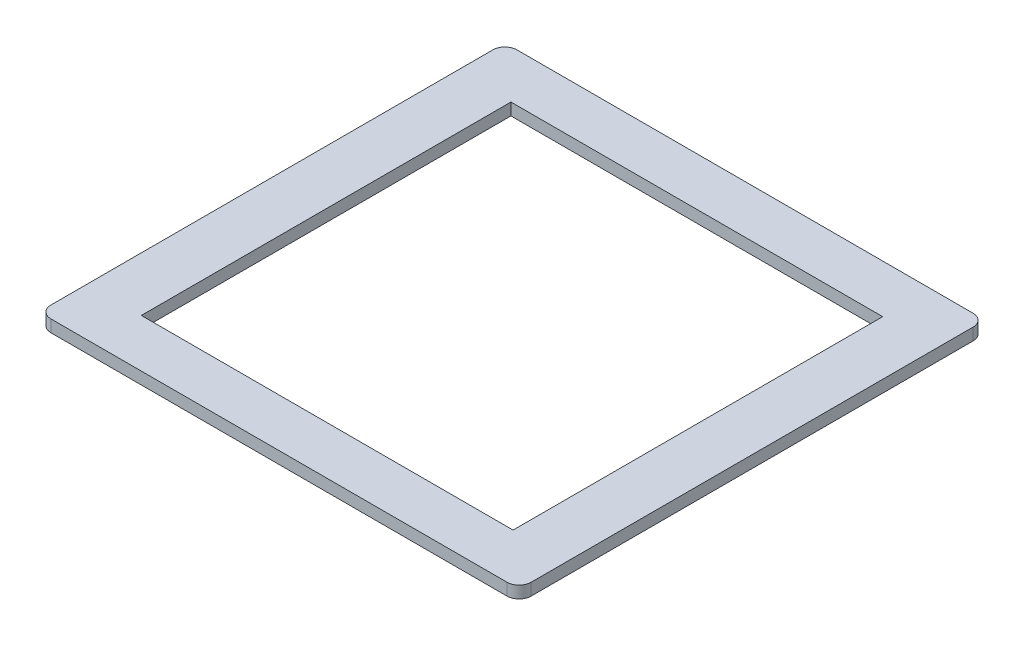
ISO-10303-21;
HEADER;
FILE_DESCRIPTION(('STEP AP214'),'2;1');
FILE_NAME('part.step','',(''),(''),'','','');
FILE_SCHEMA(('AUTOMOTIVE_DESIGN { 1 0 10303 214 1 1 1 1 }'));
ENDSEC;
DATA;
#1=APPLICATION_CONTEXT('core data for automotive mechanical design processes');
#2=APPLICATION_PROTOCOL_DEFINITION('international standard','automotive_design',2000,#1);
#3=PRODUCT_CONTEXT('',#1,'mechanical');
#4=PRODUCT('Part','Part','',(#3));
#5=PRODUCT_RELATED_PRODUCT_CATEGORY('part','',(#4));
#6=PRODUCT_DEFINITION_FORMATION('','',#4);
#7=PRODUCT_DEFINITION_CONTEXT('part definition',#1,'design');
#8=PRODUCT_DEFINITION('design','',#6,#7);
#9=PRODUCT_DEFINITION_SHAPE('','',#8);
#10=(LENGTH_UNIT() NAMED_UNIT(*) SI_UNIT(.MILLI.,.METRE.));
#11=(NAMED_UNIT(*) PLANE_ANGLE_UNIT() SI_UNIT($,.RADIAN.));
#12=(NAMED_UNIT(*) SI_UNIT($,.STERADIAN.) SOLID_ANGLE_UNIT());
#13=UNCERTAINTY_MEASURE_WITH_UNIT(LENGTH_MEASURE(1.E-05),#10,'distance_accuracy_value','');
#14=(GEOMETRIC_REPRESENTATION_CONTEXT(3) GLOBAL_UNCERTAINTY_ASSIGNED_CONTEXT((#13)) GLOBAL_UNIT_ASSIGNED_CONTEXT((#10,
#11,#12)) REPRESENTATION_CONTEXT('',''));
#15=CARTESIAN_POINT('',(0.,0.,0.));
#16=DIRECTION('',(0.,0.,1.));
#17=DIRECTION('',(1.,0.,0.));
#18=AXIS2_PLACEMENT_3D('',#15,#16,#17);
#19=CARTESIAN_POINT('',(119.15165550125,-5750.54008862985,-146.206803101356));
#20=DIRECTION('',(0.,-1.,0.));
#21=DIRECTION('',(0.,0.,-1.));
#22=AXIS2_PLACEMENT_3D('',#19,#20,#21);
#23=PLANE('',#22);
#24=CARTESIAN_POINT('',(119.15165550125,-5750.54008862985,-146.206803101356));
#25=DIRECTION('',(0.,1.,0.));
#26=DIRECTION('',(0.,0.,-1.));
#27=AXIS2_PLACEMENT_3D('',#24,#25,#26);
#28=CIRCLE('',#27,2.);
#29=CARTESIAN_POINT('',(121.15165550125,-5750.54008862985,-146.206803101356));
#30=VERTEX_POINT('',#29);
#31=CARTESIAN_POINT('',(119.15165550125,-5750.54008862985,-148.206803101356));
#32=VERTEX_POINT('',#31);
#33=EDGE_CURVE('E158',#30,#32,#28,.T.);
#34=ORIENTED_EDGE('',*,*,#33,.T.);
#35=DIRECTION('',(-1.,0.,0.));
#36=VECTOR('',#35,1.);
#37=CARTESIAN_POINT('',(43.4495128900275,-5750.54008862985,-148.206803101356));
#38=LINE('',#37,#36);
#39=CARTESIAN_POINT('',(43.4495128900275,-5750.54008862985,-148.206803101356));
#40=VERTEX_POINT('',#39);
#41=EDGE_CURVE('E161',#32,#40,#38,.T.);
#42=ORIENTED_EDGE('',*,*,#41,.T.);
#43=CARTESIAN_POINT('',(43.4495128900275,-5750.54008862985,-146.206803101356));
#44=DIRECTION('',(0.,1.,0.));
#45=DIRECTION('',(0.,0.,-1.));
#46=AXIS2_PLACEMENT_3D('',#43,#44,#45);
#47=CIRCLE('',#46,1.99999999999999);
#48=CARTESIAN_POINT('',(41.4495128900275,-5750.54008862985,-146.206803101356));
#49=VERTEX_POINT('',#48);
#50=EDGE_CURVE('E164',#40,#49,#47,.T.);
#51=ORIENTED_EDGE('',*,*,#50,.T.);
#52=DIRECTION('',(0.,0.,1.));
#53=VECTOR('',#52,1.);
#54=CARTESIAN_POINT('',(41.4495128900275,-5750.54008862985,-146.206803101356));
#55=LINE('',#54,#53);
#56=CARTESIAN_POINT('',(41.4495128900275,-5750.54008862985,-72.8595632023749));
#57=VERTEX_POINT('',#56);
#58=EDGE_CURVE('E166',#49,#57,#55,.T.);
#59=ORIENTED_EDGE('',*,*,#58,.T.);
#60=CARTESIAN_POINT('',(43.4495128900275,-5750.54008862985,-72.8595632023749));
#61=DIRECTION('',(0.,1.,0.));
#62=DIRECTION('',(0.,0.,-1.));
#63=AXIS2_PLACEMENT_3D('',#60,#61,#62);
#64=CIRCLE('',#63,2.00000000000002);
#65=CARTESIAN_POINT('',(43.4495128900275,-5750.54008862985,-70.8595632023748));
#66=VERTEX_POINT('',#65);
#67=EDGE_CURVE('E168',#57,#66,#64,.T.);
#68=ORIENTED_EDGE('',*,*,#67,.T.);
#69=DIRECTION('',(1.,0.,0.));
#70=VECTOR('',#69,1.);
#71=CARTESIAN_POINT('',(43.4495128900275,-5750.54008862985,-70.8595632023749));
#72=LINE('',#71,#70);
#73=CARTESIAN_POINT('',(119.15165550125,-5750.54008862985,-70.8595632023749));
#74=VERTEX_POINT('',#73);
#75=EDGE_CURVE('E170',#66,#74,#72,.T.);
#76=ORIENTED_EDGE('',*,*,#75,.T.);
#77=CARTESIAN_POINT('',(119.15165550125,-5750.54008862985,-72.8595632023749));
#78=DIRECTION('',(0.,1.,0.));
#79=DIRECTION('',(0.,0.,-1.));
#80=AXIS2_PLACEMENT_3D('',#77,#78,#79);
#81=CIRCLE('',#80,2.);
#82=CARTESIAN_POINT('',(121.15165550125,-5750.54008862985,-72.8595632023749));
#83=VERTEX_POINT('',#82);
#84=EDGE_CURVE('E172',#74,#83,#81,.T.);
#85=ORIENTED_EDGE('',*,*,#84,.T.);
#86=DIRECTION('',(0.,0.,-1.));
#87=VECTOR('',#86,1.);
#88=CARTESIAN_POINT('',(121.15165550125,-5750.54008862985,-146.206803101356));
#89=LINE('',#88,#87);
#90=EDGE_CURVE('E174',#83,#30,#89,.T.);
#91=ORIENTED_EDGE('',*,*,#90,.T.);
#92=EDGE_LOOP('',(#34,#42,#51,#59,#68,#76,#85,#91));
#93=FACE_BOUND('',#92,.T.);
#94=DIRECTION('',(0.,0.,1.));
#95=VECTOR('',#94,1.);
#96=CARTESIAN_POINT('',(50.4495128900275,-5750.54008862985,-140.206803101356));
#97=LINE('',#96,#95);
#98=CARTESIAN_POINT('',(50.4495128900275,-5750.54008862985,-140.206803101356));
#99=VERTEX_POINT('',#98);
#100=CARTESIAN_POINT('',(50.4495128900275,-5750.54008862985,-78.8595632023749));
#101=VERTEX_POINT('',#100);
#102=EDGE_CURVE('E122',#99,#101,#97,.T.);
#103=ORIENTED_EDGE('',*,*,#102,.F.);
#104=DIRECTION('',(-1.,0.,0.));
#105=VECTOR('',#104,1.);
#106=CARTESIAN_POINT('',(50.4495128900275,-5750.54008862985,-140.206803101356));
#107=LINE('',#106,#105);
#108=CARTESIAN_POINT('',(112.15165550125,-5750.54008862985,-140.206803101356));
#109=VERTEX_POINT('',#108);
#110=EDGE_CURVE('E144',#109,#99,#107,.T.);
#111=ORIENTED_EDGE('',*,*,#110,.F.);
#112=DIRECTION('',(0.,0.,-1.));
#113=VECTOR('',#112,1.);
#114=CARTESIAN_POINT('',(112.15165550125,-5750.54008862985,-140.206803101356));
#115=LINE('',#114,#113);
#116=CARTESIAN_POINT('',(112.15165550125,-5750.54008862985,-78.8595632023749));
#117=VERTEX_POINT('',#116);
#118=EDGE_CURVE('E142',#117,#109,#115,.T.);
#119=ORIENTED_EDGE('',*,*,#118,.F.);
#120=DIRECTION('',(1.,0.,0.));
#121=VECTOR('',#120,1.);
#122=CARTESIAN_POINT('',(50.4495128900275,-5750.54008862985,-78.8595632023749));
#123=LINE('',#122,#121);
#124=EDGE_CURVE('E130',#101,#117,#123,.T.);
#125=ORIENTED_EDGE('',*,*,#124,.F.);
#126=EDGE_LOOP('',(#103,#111,#119,#125));
#127=FACE_BOUND('',#126,.T.);
#128=ADVANCED_FACE('F33',(#93,#127),#23,.F.);
#129=CARTESIAN_POINT('',(119.15165550125,-5752.54008862985,-146.206803101356));
#130=DIRECTION('',(0.,-1.,0.));
#131=DIRECTION('',(0.,0.,-1.));
#132=AXIS2_PLACEMENT_3D('',#129,#130,#131);
#133=PLANE('',#132);
#134=CARTESIAN_POINT('',(119.15165550125,-5752.54008862985,-146.206803101356));
#135=DIRECTION('',(0.,1.,0.));
#136=DIRECTION('',(0.,0.,-1.));
#137=AXIS2_PLACEMENT_3D('',#134,#135,#136);
#138=CIRCLE('',#137,2.);
#139=CARTESIAN_POINT('',(121.15165550125,-5752.54008862985,-146.206803101356));
#140=VERTEX_POINT('',#139);
#141=CARTESIAN_POINT('',(119.15165550125,-5752.54008862985,-148.206803101356));
#142=VERTEX_POINT('',#141);
#143=EDGE_CURVE('E138',#140,#142,#138,.T.);
#144=ORIENTED_EDGE('',*,*,#143,.F.);
#145=DIRECTION('',(0.,0.,-1.));
#146=VECTOR('',#145,1.);
#147=CARTESIAN_POINT('',(121.15165550125,-5752.54008862985,-146.206803101356));
#148=LINE('',#147,#146);
#149=CARTESIAN_POINT('',(121.15165550125,-5752.54008862985,-72.8595632023749));
#150=VERTEX_POINT('',#149);
#151=EDGE_CURVE('E162',#150,#140,#148,.T.);
#152=ORIENTED_EDGE('',*,*,#151,.F.);
#153=CARTESIAN_POINT('',(119.15165550125,-5752.54008862985,-72.8595632023749));
#154=DIRECTION('',(0.,1.,0.));
#155=DIRECTION('',(0.,0.,-1.));
#156=AXIS2_PLACEMENT_3D('',#153,#154,#155);
#157=CIRCLE('',#156,2.);
#158=CARTESIAN_POINT('',(119.15165550125,-5752.54008862985,-70.8595632023749));
#159=VERTEX_POINT('',#158);
#160=EDGE_CURVE('E189',#159,#150,#157,.T.);
#161=ORIENTED_EDGE('',*,*,#160,.F.);
#162=DIRECTION('',(1.,0.,0.));
#163=VECTOR('',#162,1.);
#164=CARTESIAN_POINT('',(43.4495128900275,-5752.54008862985,-70.8595632023749));
#165=LINE('',#164,#163);
#166=CARTESIAN_POINT('',(43.4495128900275,-5752.54008862985,-70.8595632023748));
#167=VERTEX_POINT('',#166);
#168=EDGE_CURVE('E187',#167,#159,#165,.T.);
#169=ORIENTED_EDGE('',*,*,#168,.F.);
#170=CARTESIAN_POINT('',(43.4495128900275,-5752.54008862985,-72.8595632023749));
#171=DIRECTION('',(0.,1.,0.));
#172=DIRECTION('',(0.,0.,-1.));
#173=AXIS2_PLACEMENT_3D('',#170,#171,#172);
#174=CIRCLE('',#173,2.00000000000002);
#175=CARTESIAN_POINT('',(41.4495128900275,-5752.54008862985,-72.8595632023749));
#176=VERTEX_POINT('',#175);
#177=EDGE_CURVE('E185',#176,#167,#174,.T.);
#178=ORIENTED_EDGE('',*,*,#177,.F.);
#179=DIRECTION('',(0.,0.,1.));
#180=VECTOR('',#179,1.);
#181=CARTESIAN_POINT('',(41.4495128900275,-5752.54008862985,-146.206803101356));
#182=LINE('',#181,#180);
#183=CARTESIAN_POINT('',(41.4495128900275,-5752.54008862985,-146.206803101356));
#184=VERTEX_POINT('',#183);
#185=EDGE_CURVE('E183',#184,#176,#182,.T.);
#186=ORIENTED_EDGE('',*,*,#185,.F.);
#187=CARTESIAN_POINT('',(43.4495128900275,-5752.54008862985,-146.206803101356));
#188=DIRECTION('',(0.,1.,0.));
#189=DIRECTION('',(0.,0.,-1.));
#190=AXIS2_PLACEMENT_3D('',#187,#188,#189);
#191=CIRCLE('',#190,1.99999999999999);
#192=CARTESIAN_POINT('',(43.4495128900275,-5752.54008862985,-148.206803101356));
#193=VERTEX_POINT('',#192);
#194=EDGE_CURVE('E181',#193,#184,#191,.T.);
#195=ORIENTED_EDGE('',*,*,#194,.F.);
#196=DIRECTION('',(-1.,0.,0.));
#197=VECTOR('',#196,1.);
#198=CARTESIAN_POINT('',(43.4495128900275,-5752.54008862985,-148.206803101356));
#199=LINE('',#198,#197);
#200=EDGE_CURVE('E179',#142,#193,#199,.T.);
#201=ORIENTED_EDGE('',*,*,#200,.F.);
#202=EDGE_LOOP('',(#144,#152,#161,#169,#178,#186,#195,#201));
#203=FACE_BOUND('',#202,.T.);
#204=DIRECTION('',(-1.,0.,0.));
#205=VECTOR('',#204,1.);
#206=CARTESIAN_POINT('',(50.4495128900275,-5752.54008862985,-140.206803101356));
#207=LINE('',#206,#205);
#208=CARTESIAN_POINT('',(112.15165550125,-5752.54008862985,-140.206803101356));
#209=VERTEX_POINT('',#208);
#210=CARTESIAN_POINT('',(50.4495128900275,-5752.54008862985,-140.206803101356));
#211=VERTEX_POINT('',#210);
#212=EDGE_CURVE('E131',#209,#211,#207,.T.);
#213=ORIENTED_EDGE('',*,*,#212,.T.);
#214=DIRECTION('',(0.,0.,1.));
#215=VECTOR('',#214,1.);
#216=CARTESIAN_POINT('',(50.4495128900275,-5752.54008862985,-140.206803101356));
#217=LINE('',#216,#215);
#218=CARTESIAN_POINT('',(50.4495128900275,-5752.54008862985,-78.8595632023749));
#219=VERTEX_POINT('',#218);
#220=EDGE_CURVE('E56',#211,#219,#217,.T.);
#221=ORIENTED_EDGE('',*,*,#220,.T.);
#222=DIRECTION('',(1.,0.,0.));
#223=VECTOR('',#222,1.);
#224=CARTESIAN_POINT('',(50.4495128900275,-5752.54008862985,-78.8595632023749));
#225=LINE('',#224,#223);
#226=CARTESIAN_POINT('',(112.15165550125,-5752.54008862985,-78.8595632023749));
#227=VERTEX_POINT('',#226);
#228=EDGE_CURVE('E137',#219,#227,#225,.T.);
#229=ORIENTED_EDGE('',*,*,#228,.T.);
#230=DIRECTION('',(0.,0.,-1.));
#231=VECTOR('',#230,1.);
#232=CARTESIAN_POINT('',(112.15165550125,-5752.54008862985,-140.206803101356));
#233=LINE('',#232,#231);
#234=EDGE_CURVE('E150',#227,#209,#233,.T.);
#235=ORIENTED_EDGE('',*,*,#234,.T.);
#236=EDGE_LOOP('',(#213,#221,#229,#235));
#237=FACE_BOUND('',#236,.T.);
#238=ADVANCED_FACE('F219',(#203,#237),#133,.T.);
#239=CARTESIAN_POINT('',(119.15165550125,-5750.54008862985,-146.206803101356));
#240=DIRECTION('',(0.,-1.,0.));
#241=DIRECTION('',(0.,0.,-1.));
#242=AXIS2_PLACEMENT_3D('',#239,#240,#241);
#243=CYLINDRICAL_SURFACE('',#242,2.);
#244=ORIENTED_EDGE('',*,*,#143,.T.);
#245=DIRECTION('',(0.,-1.,0.));
#246=VECTOR('',#245,1.);
#247=CARTESIAN_POINT('',(119.15165550125,-5750.54008862985,-148.206803101356));
#248=LINE('',#247,#246);
#249=EDGE_CURVE('E11',#32,#142,#248,.T.);
#250=ORIENTED_EDGE('',*,*,#249,.F.);
#251=ORIENTED_EDGE('',*,*,#33,.F.);
#252=DIRECTION('',(0.,-1.,0.));
#253=VECTOR('',#252,1.);
#254=CARTESIAN_POINT('',(121.15165550125,-5750.54008862985,-146.206803101356));
#255=LINE('',#254,#253);
#256=EDGE_CURVE('E176',#30,#140,#255,.T.);
#257=ORIENTED_EDGE('',*,*,#256,.T.);
#258=EDGE_LOOP('',(#244,#250,#251,#257));
#259=FACE_BOUND('',#258,.T.);
#260=ADVANCED_FACE('F35',(#259),#243,.T.);
#261=CARTESIAN_POINT('',(43.4495128900275,-5750.54008862985,-148.206803101356));
#262=DIRECTION('',(0.,0.,1.));
#263=DIRECTION('',(1.,0.,0.));
#264=AXIS2_PLACEMENT_3D('',#261,#262,#263);
#265=PLANE('',#264);
#266=ORIENTED_EDGE('',*,*,#200,.T.);
#267=DIRECTION('',(0.,-1.,0.));
#268=VECTOR('',#267,1.);
#269=CARTESIAN_POINT('',(43.4495128900275,-5750.54008862985,-148.206803101356));
#270=LINE('',#269,#268);
#271=EDGE_CURVE('E41',#40,#193,#270,.T.);
#272=ORIENTED_EDGE('',*,*,#271,.F.);
#273=ORIENTED_EDGE('',*,*,#41,.F.);
#274=ORIENTED_EDGE('',*,*,#249,.T.);
#275=EDGE_LOOP('',(#266,#272,#273,#274));
#276=FACE_BOUND('',#275,.T.);
#277=ADVANCED_FACE('F236',(#276),#265,.F.);
#278=CARTESIAN_POINT('',(43.4495128900275,-5750.54008862985,-146.206803101356));
#279=DIRECTION('',(0.,-1.,0.));
#280=DIRECTION('',(0.,0.,-1.));
#281=AXIS2_PLACEMENT_3D('',#278,#279,#280);
#282=CYLINDRICAL_SURFACE('',#281,1.99999999999999);
#283=ORIENTED_EDGE('',*,*,#194,.T.);
#284=DIRECTION('',(0.,-1.,0.));
#285=VECTOR('',#284,1.);
#286=CARTESIAN_POINT('',(41.4495128900275,-5750.54008862985,-146.206803101356));
#287=LINE('',#286,#285);
#288=EDGE_CURVE('E206',#49,#184,#287,.T.);
#289=ORIENTED_EDGE('',*,*,#288,.F.);
#290=ORIENTED_EDGE('',*,*,#50,.F.);
#291=ORIENTED_EDGE('',*,*,#271,.T.);
#292=EDGE_LOOP('',(#283,#289,#290,#291));
#293=FACE_BOUND('',#292,.T.);
#294=ADVANCED_FACE('F213',(#293),#282,.T.);
#295=CARTESIAN_POINT('',(41.4495128900275,-5750.54008862985,-146.206803101356));
#296=DIRECTION('',(1.,0.,0.));
#297=DIRECTION('',(0.,0.,-1.));
#298=AXIS2_PLACEMENT_3D('',#295,#296,#297);
#299=PLANE('',#298);
#300=ORIENTED_EDGE('',*,*,#185,.T.);
#301=DIRECTION('',(0.,-1.,0.));
#302=VECTOR('',#301,1.);
#303=CARTESIAN_POINT('',(41.4495128900275,-5750.54008862985,-72.8595632023749));
#304=LINE('',#303,#302);
#305=EDGE_CURVE('E203',#57,#176,#304,.T.);
#306=ORIENTED_EDGE('',*,*,#305,.F.);
#307=ORIENTED_EDGE('',*,*,#58,.F.);
#308=ORIENTED_EDGE('',*,*,#288,.T.);
#309=EDGE_LOOP('',(#300,#306,#307,#308));
#310=FACE_BOUND('',#309,.T.);
#311=ADVANCED_FACE('F225',(#310),#299,.F.);
#312=CARTESIAN_POINT('',(43.4495128900275,-5750.54008862985,-72.8595632023749));
#313=DIRECTION('',(0.,-1.,0.));
#314=DIRECTION('',(0.,0.,-1.));
#315=AXIS2_PLACEMENT_3D('',#312,#313,#314);
#316=CYLINDRICAL_SURFACE('',#315,2.00000000000002);
#317=ORIENTED_EDGE('',*,*,#177,.T.);
#318=DIRECTION('',(0.,-1.,0.));
#319=VECTOR('',#318,1.);
#320=CARTESIAN_POINT('',(43.4495128900275,-5750.54008862985,-70.8595632023748));
#321=LINE('',#320,#319);
#322=EDGE_CURVE('E200',#66,#167,#321,.T.);
#323=ORIENTED_EDGE('',*,*,#322,.F.);
#324=ORIENTED_EDGE('',*,*,#67,.F.);
#325=ORIENTED_EDGE('',*,*,#305,.T.);
#326=EDGE_LOOP('',(#317,#323,#324,#325));
#327=FACE_BOUND('',#326,.T.);
#328=ADVANCED_FACE('F229',(#327),#316,.T.);
#329=CARTESIAN_POINT('',(43.4495128900275,-5750.54008862985,-70.8595632023749));
#330=DIRECTION('',(0.,0.,-1.));
#331=DIRECTION('',(-1.,0.,0.));
#332=AXIS2_PLACEMENT_3D('',#329,#330,#331);
#333=PLANE('',#332);
#334=ORIENTED_EDGE('',*,*,#168,.T.);
#335=DIRECTION('',(0.,-1.,0.));
#336=VECTOR('',#335,1.);
#337=CARTESIAN_POINT('',(119.15165550125,-5750.54008862985,-70.8595632023749));
#338=LINE('',#337,#336);
#339=EDGE_CURVE('E197',#74,#159,#338,.T.);
#340=ORIENTED_EDGE('',*,*,#339,.F.);
#341=ORIENTED_EDGE('',*,*,#75,.F.);
#342=ORIENTED_EDGE('',*,*,#322,.T.);
#343=EDGE_LOOP('',(#334,#340,#341,#342));
#344=FACE_BOUND('',#343,.T.);
#345=ADVANCED_FACE('F249',(#344),#333,.F.);
#346=CARTESIAN_POINT('',(119.15165550125,-5750.54008862985,-72.8595632023749));
#347=DIRECTION('',(0.,-1.,0.));
#348=DIRECTION('',(0.,0.,-1.));
#349=AXIS2_PLACEMENT_3D('',#346,#347,#348);
#350=CYLINDRICAL_SURFACE('',#349,2.);
#351=ORIENTED_EDGE('',*,*,#160,.T.);
#352=DIRECTION('',(0.,-1.,0.));
#353=VECTOR('',#352,1.);
#354=CARTESIAN_POINT('',(121.15165550125,-5750.54008862985,-72.8595632023749));
#355=LINE('',#354,#353);
#356=EDGE_CURVE('E194',#83,#150,#355,.T.);
#357=ORIENTED_EDGE('',*,*,#356,.F.);
#358=ORIENTED_EDGE('',*,*,#84,.F.);
#359=ORIENTED_EDGE('',*,*,#339,.T.);
#360=EDGE_LOOP('',(#351,#357,#358,#359));
#361=FACE_BOUND('',#360,.T.);
#362=ADVANCED_FACE('F247',(#361),#350,.T.);
#363=CARTESIAN_POINT('',(121.15165550125,-5750.54008862985,-146.206803101356));
#364=DIRECTION('',(-1.,0.,0.));
#365=DIRECTION('',(0.,0.,1.));
#366=AXIS2_PLACEMENT_3D('',#363,#364,#365);
#367=PLANE('',#366);
#368=ORIENTED_EDGE('',*,*,#151,.T.);
#369=ORIENTED_EDGE('',*,*,#256,.F.);
#370=ORIENTED_EDGE('',*,*,#90,.F.);
#371=ORIENTED_EDGE('',*,*,#356,.T.);
#372=EDGE_LOOP('',(#368,#369,#370,#371));
#373=FACE_BOUND('',#372,.T.);
#374=ADVANCED_FACE('F242',(#373),#367,.F.);
#375=CARTESIAN_POINT('',(50.4495128900275,-5750.54008862985,-140.206803101356));
#376=DIRECTION('',(1.,0.,0.));
#377=DIRECTION('',(0.,0.,-1.));
#378=AXIS2_PLACEMENT_3D('',#375,#376,#377);
#379=PLANE('',#378);
#380=ORIENTED_EDGE('',*,*,#220,.F.);
#381=DIRECTION('',(0.,-1.,0.));
#382=VECTOR('',#381,1.);
#383=CARTESIAN_POINT('',(50.4495128900275,-5750.54008862985,-140.206803101356));
#384=LINE('',#383,#382);
#385=EDGE_CURVE('E126',#99,#211,#384,.T.);
#386=ORIENTED_EDGE('',*,*,#385,.F.);
#387=ORIENTED_EDGE('',*,*,#102,.T.);
#388=DIRECTION('',(0.,-1.,0.));
#389=VECTOR('',#388,1.);
#390=CARTESIAN_POINT('',(50.4495128900275,-5750.54008862985,-78.8595632023749));
#391=LINE('',#390,#389);
#392=EDGE_CURVE('E125',#101,#219,#391,.T.);
#393=ORIENTED_EDGE('',*,*,#392,.T.);
#394=EDGE_LOOP('',(#380,#386,#387,#393));
#395=FACE_BOUND('',#394,.T.);
#396=ADVANCED_FACE('F124',(#395),#379,.T.);
#397=CARTESIAN_POINT('',(50.4495128900275,-5750.54008862985,-78.8595632023749));
#398=DIRECTION('',(0.,0.,-1.));
#399=DIRECTION('',(-1.,0.,0.));
#400=AXIS2_PLACEMENT_3D('',#397,#398,#399);
#401=PLANE('',#400);
#402=ORIENTED_EDGE('',*,*,#228,.F.);
#403=ORIENTED_EDGE('',*,*,#392,.F.);
#404=ORIENTED_EDGE('',*,*,#124,.T.);
#405=DIRECTION('',(0.,-1.,0.));
#406=VECTOR('',#405,1.);
#407=CARTESIAN_POINT('',(112.15165550125,-5750.54008862985,-78.8595632023749));
#408=LINE('',#407,#406);
#409=EDGE_CURVE('E139',#117,#227,#408,.T.);
#410=ORIENTED_EDGE('',*,*,#409,.T.);
#411=EDGE_LOOP('',(#402,#403,#404,#410));
#412=FACE_BOUND('',#411,.T.);
#413=ADVANCED_FACE('F134',(#412),#401,.T.);
#414=CARTESIAN_POINT('',(112.15165550125,-5750.54008862985,-140.206803101356));
#415=DIRECTION('',(-1.,0.,0.));
#416=DIRECTION('',(0.,0.,1.));
#417=AXIS2_PLACEMENT_3D('',#414,#415,#416);
#418=PLANE('',#417);
#419=ORIENTED_EDGE('',*,*,#234,.F.);
#420=ORIENTED_EDGE('',*,*,#409,.F.);
#421=ORIENTED_EDGE('',*,*,#118,.T.);
#422=DIRECTION('',(0.,-1.,0.));
#423=VECTOR('',#422,1.);
#424=CARTESIAN_POINT('',(112.15165550125,-5750.54008862985,-140.206803101356));
#425=LINE('',#424,#423);
#426=EDGE_CURVE('E48',#109,#209,#425,.T.);
#427=ORIENTED_EDGE('',*,*,#426,.T.);
#428=EDGE_LOOP('',(#419,#420,#421,#427));
#429=FACE_BOUND('',#428,.T.);
#430=ADVANCED_FACE('F274',(#429),#418,.T.);
#431=CARTESIAN_POINT('',(50.4495128900275,-5750.54008862985,-140.206803101356));
#432=DIRECTION('',(0.,0.,1.));
#433=DIRECTION('',(1.,0.,0.));
#434=AXIS2_PLACEMENT_3D('',#431,#432,#433);
#435=PLANE('',#434);
#436=ORIENTED_EDGE('',*,*,#212,.F.);
#437=ORIENTED_EDGE('',*,*,#426,.F.);
#438=ORIENTED_EDGE('',*,*,#110,.T.);
#439=ORIENTED_EDGE('',*,*,#385,.T.);
#440=EDGE_LOOP('',(#436,#437,#438,#439));
#441=FACE_BOUND('',#440,.T.);
#442=ADVANCED_FACE('F278',(#441),#435,.T.);
#443=CLOSED_SHELL('',(#128,#238,#260,#277,#294,#311,#328,#345,#362,#374,#396,#413,#430,#442));
#444=MANIFOLD_SOLID_BREP('B2',#443);
#445=ADVANCED_BREP_SHAPE_REPRESENTATION('',(#18,#444),#14);
#446=SHAPE_DEFINITION_REPRESENTATION(#9,#445);
ENDSEC;
END-ISO-10303-21;
